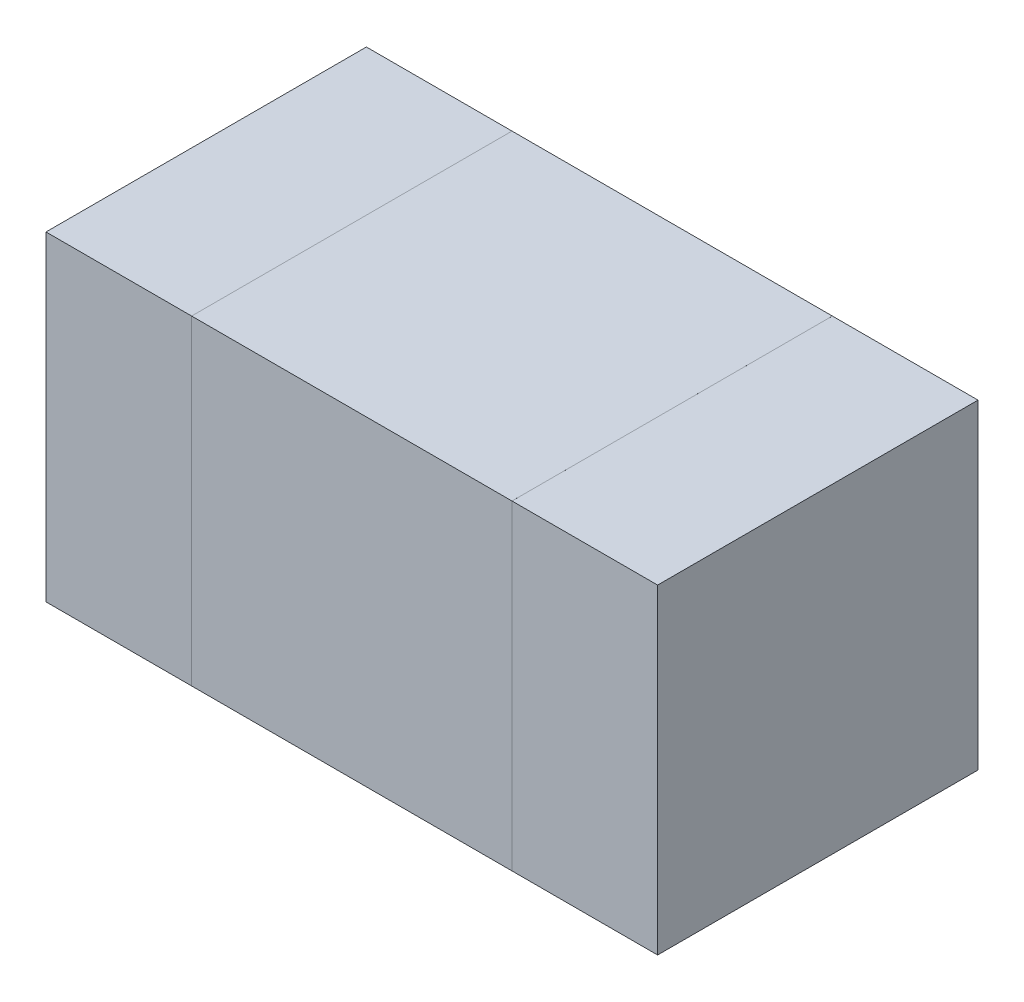
ISO-10303-21;
HEADER;
FILE_DESCRIPTION(('STEP AP214'),'2;1');
FILE_NAME('part.step','',(''),(''),'','','');
FILE_SCHEMA(('AUTOMOTIVE_DESIGN { 1 0 10303 214 1 1 1 1 }'));
ENDSEC;
DATA;
#1=APPLICATION_CONTEXT('core data for automotive mechanical design processes');
#2=APPLICATION_PROTOCOL_DEFINITION('international standard','automotive_design',2000,#1);
#3=PRODUCT_CONTEXT('',#1,'mechanical');
#4=PRODUCT('Part','Part','',(#3));
#5=PRODUCT_RELATED_PRODUCT_CATEGORY('part','',(#4));
#6=PRODUCT_DEFINITION_FORMATION('','',#4);
#7=PRODUCT_DEFINITION_CONTEXT('part definition',#1,'design');
#8=PRODUCT_DEFINITION('design','',#6,#7);
#9=PRODUCT_DEFINITION_SHAPE('','',#8);
#10=(LENGTH_UNIT() NAMED_UNIT(*) SI_UNIT(.MILLI.,.METRE.));
#11=(NAMED_UNIT(*) PLANE_ANGLE_UNIT() SI_UNIT($,.RADIAN.));
#12=(NAMED_UNIT(*) SI_UNIT($,.STERADIAN.) SOLID_ANGLE_UNIT());
#13=UNCERTAINTY_MEASURE_WITH_UNIT(LENGTH_MEASURE(1.E-05),#10,'distance_accuracy_value','');
#14=(GEOMETRIC_REPRESENTATION_CONTEXT(3) GLOBAL_UNCERTAINTY_ASSIGNED_CONTEXT((#13)) GLOBAL_UNIT_ASSIGNED_CONTEXT((#10,
#11,#12)) REPRESENTATION_CONTEXT('',''));
#15=CARTESIAN_POINT('',(0.,0.,0.));
#16=DIRECTION('',(0.,0.,1.));
#17=DIRECTION('',(1.,0.,0.));
#18=AXIS2_PLACEMENT_3D('',#15,#16,#17);
#19=CARTESIAN_POINT('',(2.68499097418,8.760001486074,0.32999934));
#20=DIRECTION('',(0.,0.,-1.));
#21=DIRECTION('',(0.,-1.,0.));
#22=AXIS2_PLACEMENT_3D('',#19,#20,#21);
#23=PLANE('',#22);
#24=DIRECTION('',(1.,0.,0.));
#25=VECTOR('',#24,1.);
#26=CARTESIAN_POINT('',(2.68499097418,8.760001486074,0.32999934));
#27=LINE('',#26,#25);
#28=CARTESIAN_POINT('',(2.68499097418,8.760001486074,0.32999934));
#29=VERTEX_POINT('',#28);
#30=CARTESIAN_POINT('',(3.01499285418,8.760001486074,0.32999934));
#31=VERTEX_POINT('',#30);
#32=EDGE_CURVE('P0_E83',#29,#31,#27,.T.);
#33=ORIENTED_EDGE('',*,*,#32,.T.);
#34=DIRECTION('',(0.,1.,0.));
#35=VECTOR('',#34,1.);
#36=CARTESIAN_POINT('',(3.01499285418,8.760001486074,0.32999934));
#37=LINE('',#36,#35);
#38=CARTESIAN_POINT('',(3.01499285418,9.090000826074,0.32999934));
#39=VERTEX_POINT('',#38);
#40=EDGE_CURVE('P0_E81',#31,#39,#37,.T.);
#41=ORIENTED_EDGE('',*,*,#40,.T.);
#42=DIRECTION('',(-1.,0.,0.));
#43=VECTOR('',#42,1.);
#44=CARTESIAN_POINT('',(3.01499285418,9.090000826074,0.32999934));
#45=LINE('',#44,#43);
#46=CARTESIAN_POINT('',(2.68499097418,9.090000826074,0.32999934));
#47=VERTEX_POINT('',#46);
#48=EDGE_CURVE('P0_E71',#39,#47,#45,.T.);
#49=ORIENTED_EDGE('',*,*,#48,.T.);
#50=DIRECTION('',(0.,-1.,0.));
#51=VECTOR('',#50,1.);
#52=CARTESIAN_POINT('',(2.68499097418,9.090000826074,0.32999934));
#53=LINE('',#52,#51);
#54=EDGE_CURVE('P0_E11',#47,#29,#53,.T.);
#55=ORIENTED_EDGE('',*,*,#54,.T.);
#56=EDGE_LOOP('',(#33,#41,#49,#55));
#57=FACE_BOUND('',#56,.T.);
#58=ADVANCED_FACE('P0_F17',(#57),#23,.F.);
#59=CARTESIAN_POINT('',(2.68499097418,8.760001486074,0.));
#60=DIRECTION('',(0.,0.,-1.));
#61=DIRECTION('',(0.,-1.,0.));
#62=AXIS2_PLACEMENT_3D('',#59,#60,#61);
#63=PLANE('',#62);
#64=DIRECTION('',(0.,-1.,0.));
#65=VECTOR('',#64,1.);
#66=CARTESIAN_POINT('',(2.68499097418,9.090000826074,0.));
#67=LINE('',#66,#65);
#68=CARTESIAN_POINT('',(2.68499097418,9.090000826074,0.));
#69=VERTEX_POINT('',#68);
#70=CARTESIAN_POINT('',(2.68499097418,8.760001486074,0.));
#71=VERTEX_POINT('',#70);
#72=EDGE_CURVE('P0_E20',#69,#71,#67,.T.);
#73=ORIENTED_EDGE('',*,*,#72,.F.);
#74=DIRECTION('',(-1.,0.,0.));
#75=VECTOR('',#74,1.);
#76=CARTESIAN_POINT('',(3.01499285418,9.090000826074,0.));
#77=LINE('',#76,#75);
#78=CARTESIAN_POINT('',(3.01499285418,9.090000826074,0.));
#79=VERTEX_POINT('',#78);
#80=EDGE_CURVE('P0_E64',#79,#69,#77,.T.);
#81=ORIENTED_EDGE('',*,*,#80,.F.);
#82=DIRECTION('',(0.,1.,0.));
#83=VECTOR('',#82,1.);
#84=CARTESIAN_POINT('',(3.01499285418,8.760001486074,0.));
#85=LINE('',#84,#83);
#86=CARTESIAN_POINT('',(3.01499285418,8.760001486074,0.));
#87=VERTEX_POINT('',#86);
#88=EDGE_CURVE('P0_E90',#87,#79,#85,.T.);
#89=ORIENTED_EDGE('',*,*,#88,.F.);
#90=DIRECTION('',(1.,0.,0.));
#91=VECTOR('',#90,1.);
#92=CARTESIAN_POINT('',(2.68499097418,8.760001486074,0.));
#93=LINE('',#92,#91);
#94=EDGE_CURVE('P0_E166',#71,#87,#93,.T.);
#95=ORIENTED_EDGE('',*,*,#94,.F.);
#96=EDGE_LOOP('',(#73,#81,#89,#95));
#97=FACE_BOUND('',#96,.T.);
#98=ADVANCED_FACE('P0_F136',(#97),#63,.T.);
#99=CARTESIAN_POINT('',(2.68499097418,9.090000826074,0.));
#100=DIRECTION('',(1.,0.,0.));
#101=DIRECTION('',(0.,1.,0.));
#102=AXIS2_PLACEMENT_3D('',#99,#100,#101);
#103=PLANE('',#102);
#104=ORIENTED_EDGE('',*,*,#72,.T.);
#105=DIRECTION('',(0.,0.,1.));
#106=VECTOR('',#105,1.);
#107=CARTESIAN_POINT('',(2.68499097418,8.760001486074,0.));
#108=LINE('',#107,#106);
#109=EDGE_CURVE('P0_E95',#71,#29,#108,.T.);
#110=ORIENTED_EDGE('',*,*,#109,.T.);
#111=ORIENTED_EDGE('',*,*,#54,.F.);
#112=DIRECTION('',(0.,0.,1.));
#113=VECTOR('',#112,1.);
#114=CARTESIAN_POINT('',(2.68499097418,9.090000826074,0.));
#115=LINE('',#114,#113);
#116=EDGE_CURVE('P0_E77',#69,#47,#115,.T.);
#117=ORIENTED_EDGE('',*,*,#116,.F.);
#118=EDGE_LOOP('',(#104,#110,#111,#117));
#119=FACE_BOUND('',#118,.T.);
#120=ADVANCED_FACE('P0_F129',(#119),#103,.F.);
#121=CARTESIAN_POINT('',(3.01499285418,9.090000826074,0.));
#122=DIRECTION('',(0.,-1.,0.));
#123=DIRECTION('',(0.,0.,-1.));
#124=AXIS2_PLACEMENT_3D('',#121,#122,#123);
#125=PLANE('',#124);
#126=ORIENTED_EDGE('',*,*,#80,.T.);
#127=ORIENTED_EDGE('',*,*,#116,.T.);
#128=ORIENTED_EDGE('',*,*,#48,.F.);
#129=DIRECTION('',(0.,0.,1.));
#130=VECTOR('',#129,1.);
#131=CARTESIAN_POINT('',(3.01499285418,9.090000826074,0.));
#132=LINE('',#131,#130);
#133=EDGE_CURVE('P0_E75',#79,#39,#132,.T.);
#134=ORIENTED_EDGE('',*,*,#133,.F.);
#135=EDGE_LOOP('',(#126,#127,#128,#134));
#136=FACE_BOUND('',#135,.T.);
#137=ADVANCED_FACE('P0_F73',(#136),#125,.F.);
#138=CARTESIAN_POINT('',(3.01499285418,8.760001486074,0.));
#139=DIRECTION('',(-1.,0.,0.));
#140=DIRECTION('',(0.,0.,1.));
#141=AXIS2_PLACEMENT_3D('',#138,#139,#140);
#142=PLANE('',#141);
#143=ORIENTED_EDGE('',*,*,#88,.T.);
#144=ORIENTED_EDGE('',*,*,#133,.T.);
#145=ORIENTED_EDGE('',*,*,#40,.F.);
#146=DIRECTION('',(0.,0.,1.));
#147=VECTOR('',#146,1.);
#148=CARTESIAN_POINT('',(3.01499285418,8.760001486074,0.));
#149=LINE('',#148,#147);
#150=EDGE_CURVE('P0_E171',#87,#31,#149,.T.);
#151=ORIENTED_EDGE('',*,*,#150,.F.);
#152=EDGE_LOOP('',(#143,#144,#145,#151));
#153=FACE_BOUND('',#152,.T.);
#154=ADVANCED_FACE('P0_F89',(#153),#142,.F.);
#155=CARTESIAN_POINT('',(2.68499097418,8.760001486074,0.));
#156=DIRECTION('',(0.,1.,0.));
#157=DIRECTION('',(1.,0.,0.));
#158=AXIS2_PLACEMENT_3D('',#155,#156,#157);
#159=PLANE('',#158);
#160=ORIENTED_EDGE('',*,*,#94,.T.);
#161=ORIENTED_EDGE('',*,*,#150,.T.);
#162=ORIENTED_EDGE('',*,*,#32,.F.);
#163=ORIENTED_EDGE('',*,*,#109,.F.);
#164=EDGE_LOOP('',(#160,#161,#162,#163));
#165=FACE_BOUND('',#164,.T.);
#166=ADVANCED_FACE('P0_F110',(#165),#159,.F.);
#167=CLOSED_SHELL('',(#58,#98,#120,#137,#154,#166));
#168=MANIFOLD_SOLID_BREP('P0_B1',#167);
#169=CARTESIAN_POINT('',(3.164998527344,8.759998946074,0.32999934));
#170=DIRECTION('',(0.,0.,-1.));
#171=DIRECTION('',(0.,-1.,0.));
#172=AXIS2_PLACEMENT_3D('',#169,#170,#171);
#173=PLANE('',#172);
#174=DIRECTION('',(0.,1.,0.));
#175=VECTOR('',#174,1.);
#176=CARTESIAN_POINT('',(3.164998527344,8.759998946074,0.32999934));
#177=LINE('',#176,#175);
#178=CARTESIAN_POINT('',(3.164998527344,8.759998946074,0.32999934));
#179=VERTEX_POINT('',#178);
#180=CARTESIAN_POINT('',(3.164998527344,9.090000826074,0.32999934));
#181=VERTEX_POINT('',#180);
#182=EDGE_CURVE('P1_E82',#179,#181,#177,.T.);
#183=ORIENTED_EDGE('',*,*,#182,.T.);
#184=DIRECTION('',(-1.,0.,0.));
#185=VECTOR('',#184,1.);
#186=CARTESIAN_POINT('',(3.164998527344,9.090000826074,0.32999934));
#187=LINE('',#186,#185);
#188=CARTESIAN_POINT('',(3.014996287344,9.090000826074,0.32999934));
#189=VERTEX_POINT('',#188);
#190=EDGE_CURVE('P1_E104',#181,#189,#187,.T.);
#191=ORIENTED_EDGE('',*,*,#190,.T.);
#192=DIRECTION('',(0.,-1.,0.));
#193=VECTOR('',#192,1.);
#194=CARTESIAN_POINT('',(3.014996287344,9.090000826074,0.32999934));
#195=LINE('',#194,#193);
#196=CARTESIAN_POINT('',(3.014996287344,8.759998946074,0.32999934));
#197=VERTEX_POINT('',#196);
#198=EDGE_CURVE('P1_E74',#189,#197,#195,.T.);
#199=ORIENTED_EDGE('',*,*,#198,.T.);
#200=DIRECTION('',(1.,0.,0.));
#201=VECTOR('',#200,1.);
#202=CARTESIAN_POINT('',(3.014996287344,8.759998946074,0.32999934));
#203=LINE('',#202,#201);
#204=EDGE_CURVE('P1_E11',#197,#179,#203,.T.);
#205=ORIENTED_EDGE('',*,*,#204,.T.);
#206=EDGE_LOOP('',(#183,#191,#199,#205));
#207=FACE_BOUND('',#206,.T.);
#208=ADVANCED_FACE('P1_F17',(#207),#173,.F.);
#209=CARTESIAN_POINT('',(3.164998527344,8.759998946074,0.));
#210=DIRECTION('',(0.,0.,-1.));
#211=DIRECTION('',(0.,-1.,0.));
#212=AXIS2_PLACEMENT_3D('',#209,#210,#211);
#213=PLANE('',#212);
#214=DIRECTION('',(1.,0.,0.));
#215=VECTOR('',#214,1.);
#216=CARTESIAN_POINT('',(3.014996287344,8.759998946074,0.));
#217=LINE('',#216,#215);
#218=CARTESIAN_POINT('',(3.014996287344,8.759998946074,0.));
#219=VERTEX_POINT('',#218);
#220=CARTESIAN_POINT('',(3.164998527344,8.759998946074,0.));
#221=VERTEX_POINT('',#220);
#222=EDGE_CURVE('P1_E25',#219,#221,#217,.T.);
#223=ORIENTED_EDGE('',*,*,#222,.F.);
#224=DIRECTION('',(0.,-1.,0.));
#225=VECTOR('',#224,1.);
#226=CARTESIAN_POINT('',(3.014996287344,9.090000826074,0.));
#227=LINE('',#226,#225);
#228=CARTESIAN_POINT('',(3.014996287344,9.090000826074,0.));
#229=VERTEX_POINT('',#228);
#230=EDGE_CURVE('P1_E108',#229,#219,#227,.T.);
#231=ORIENTED_EDGE('',*,*,#230,.F.);
#232=DIRECTION('',(-1.,0.,0.));
#233=VECTOR('',#232,1.);
#234=CARTESIAN_POINT('',(3.164998527344,9.090000826074,0.));
#235=LINE('',#234,#233);
#236=CARTESIAN_POINT('',(3.164998527344,9.090000826074,0.));
#237=VERTEX_POINT('',#236);
#238=EDGE_CURVE('P1_E84',#237,#229,#235,.T.);
#239=ORIENTED_EDGE('',*,*,#238,.F.);
#240=DIRECTION('',(0.,1.,0.));
#241=VECTOR('',#240,1.);
#242=CARTESIAN_POINT('',(3.164998527344,8.759998946074,0.));
#243=LINE('',#242,#241);
#244=EDGE_CURVE('P1_E80',#221,#237,#243,.T.);
#245=ORIENTED_EDGE('',*,*,#244,.F.);
#246=EDGE_LOOP('',(#223,#231,#239,#245));
#247=FACE_BOUND('',#246,.T.);
#248=ADVANCED_FACE('P1_F86',(#247),#213,.T.);
#249=CARTESIAN_POINT('',(3.014996287344,8.759998946074,0.));
#250=DIRECTION('',(0.,1.,0.));
#251=DIRECTION('',(1.,0.,0.));
#252=AXIS2_PLACEMENT_3D('',#249,#250,#251);
#253=PLANE('',#252);
#254=ORIENTED_EDGE('',*,*,#222,.T.);
#255=DIRECTION('',(0.,0.,1.));
#256=VECTOR('',#255,1.);
#257=CARTESIAN_POINT('',(3.164998527344,8.759998946074,0.));
#258=LINE('',#257,#256);
#259=EDGE_CURVE('P1_E68',#221,#179,#258,.T.);
#260=ORIENTED_EDGE('',*,*,#259,.T.);
#261=ORIENTED_EDGE('',*,*,#204,.F.);
#262=DIRECTION('',(0.,0.,1.));
#263=VECTOR('',#262,1.);
#264=CARTESIAN_POINT('',(3.014996287344,8.759998946074,0.));
#265=LINE('',#264,#263);
#266=EDGE_CURVE('P1_E71',#219,#197,#265,.T.);
#267=ORIENTED_EDGE('',*,*,#266,.F.);
#268=EDGE_LOOP('',(#254,#260,#261,#267));
#269=FACE_BOUND('',#268,.T.);
#270=ADVANCED_FACE('P1_F67',(#269),#253,.F.);
#271=CARTESIAN_POINT('',(3.014996287344,9.090000826074,0.));
#272=DIRECTION('',(1.,0.,0.));
#273=DIRECTION('',(0.,1.,0.));
#274=AXIS2_PLACEMENT_3D('',#271,#272,#273);
#275=PLANE('',#274);
#276=ORIENTED_EDGE('',*,*,#230,.T.);
#277=ORIENTED_EDGE('',*,*,#266,.T.);
#278=ORIENTED_EDGE('',*,*,#198,.F.);
#279=DIRECTION('',(0.,0.,1.));
#280=VECTOR('',#279,1.);
#281=CARTESIAN_POINT('',(3.014996287344,9.090000826074,0.));
#282=LINE('',#281,#280);
#283=EDGE_CURVE('P1_E97',#229,#189,#282,.T.);
#284=ORIENTED_EDGE('',*,*,#283,.F.);
#285=EDGE_LOOP('',(#276,#277,#278,#284));
#286=FACE_BOUND('',#285,.T.);
#287=ADVANCED_FACE('P1_F117',(#286),#275,.F.);
#288=CARTESIAN_POINT('',(3.164998527344,9.090000826074,0.));
#289=DIRECTION('',(0.,-1.,0.));
#290=DIRECTION('',(0.,0.,-1.));
#291=AXIS2_PLACEMENT_3D('',#288,#289,#290);
#292=PLANE('',#291);
#293=ORIENTED_EDGE('',*,*,#238,.T.);
#294=ORIENTED_EDGE('',*,*,#283,.T.);
#295=ORIENTED_EDGE('',*,*,#190,.F.);
#296=DIRECTION('',(0.,0.,1.));
#297=VECTOR('',#296,1.);
#298=CARTESIAN_POINT('',(3.164998527344,9.090000826074,0.));
#299=LINE('',#298,#297);
#300=EDGE_CURVE('P1_E90',#237,#181,#299,.T.);
#301=ORIENTED_EDGE('',*,*,#300,.F.);
#302=EDGE_LOOP('',(#293,#294,#295,#301));
#303=FACE_BOUND('',#302,.T.);
#304=ADVANCED_FACE('P1_F119',(#303),#292,.F.);
#305=CARTESIAN_POINT('',(3.164998527344,8.759998946074,0.));
#306=DIRECTION('',(-1.,0.,0.));
#307=DIRECTION('',(0.,0.,1.));
#308=AXIS2_PLACEMENT_3D('',#305,#306,#307);
#309=PLANE('',#308);
#310=ORIENTED_EDGE('',*,*,#244,.T.);
#311=ORIENTED_EDGE('',*,*,#300,.T.);
#312=ORIENTED_EDGE('',*,*,#182,.F.);
#313=ORIENTED_EDGE('',*,*,#259,.F.);
#314=EDGE_LOOP('',(#310,#311,#312,#313));
#315=FACE_BOUND('',#314,.T.);
#316=ADVANCED_FACE('P1_F78',(#315),#309,.F.);
#317=CLOSED_SHELL('',(#208,#248,#270,#287,#304,#316));
#318=MANIFOLD_SOLID_BREP('P1_B1',#317);
#319=CARTESIAN_POINT('',(2.685002799805,8.759998946074,0.32999934));
#320=DIRECTION('',(0.,0.,-1.));
#321=DIRECTION('',(0.,-1.,0.));
#322=AXIS2_PLACEMENT_3D('',#319,#320,#321);
#323=PLANE('',#322);
#324=DIRECTION('',(0.,1.,0.));
#325=VECTOR('',#324,1.);
#326=CARTESIAN_POINT('',(2.685002799805,8.759998946074,0.32999934));
#327=LINE('',#326,#325);
#328=CARTESIAN_POINT('',(2.685002799805,8.759998946074,0.32999934));
#329=VERTEX_POINT('',#328);
#330=CARTESIAN_POINT('',(2.685002799805,9.090000826074,0.32999934));
#331=VERTEX_POINT('',#330);
#332=EDGE_CURVE('P2_E95',#329,#331,#327,.T.);
#333=ORIENTED_EDGE('',*,*,#332,.T.);
#334=DIRECTION('',(-1.,0.,0.));
#335=VECTOR('',#334,1.);
#336=CARTESIAN_POINT('',(2.685002799805,9.090000826074,0.32999934));
#337=LINE('',#336,#335);
#338=CARTESIAN_POINT('',(2.535000559805,9.090000826074,0.32999934));
#339=VERTEX_POINT('',#338);
#340=EDGE_CURVE('P2_E76',#331,#339,#337,.T.);
#341=ORIENTED_EDGE('',*,*,#340,.T.);
#342=DIRECTION('',(0.,-1.,0.));
#343=VECTOR('',#342,1.);
#344=CARTESIAN_POINT('',(2.535000559805,9.090000826074,0.32999934));
#345=LINE('',#344,#343);
#346=CARTESIAN_POINT('',(2.535000559805,8.759998946074,0.32999934));
#347=VERTEX_POINT('',#346);
#348=EDGE_CURVE('P2_E81',#339,#347,#345,.T.);
#349=ORIENTED_EDGE('',*,*,#348,.T.);
#350=DIRECTION('',(1.,0.,0.));
#351=VECTOR('',#350,1.);
#352=CARTESIAN_POINT('',(2.535000559805,8.759998946074,0.32999934));
#353=LINE('',#352,#351);
#354=EDGE_CURVE('P2_E11',#347,#329,#353,.T.);
#355=ORIENTED_EDGE('',*,*,#354,.T.);
#356=EDGE_LOOP('',(#333,#341,#349,#355));
#357=FACE_BOUND('',#356,.T.);
#358=ADVANCED_FACE('P2_F17',(#357),#323,.F.);
#359=CARTESIAN_POINT('',(2.685002799805,8.759998946074,0.));
#360=DIRECTION('',(0.,0.,-1.));
#361=DIRECTION('',(0.,-1.,0.));
#362=AXIS2_PLACEMENT_3D('',#359,#360,#361);
#363=PLANE('',#362);
#364=DIRECTION('',(1.,0.,0.));
#365=VECTOR('',#364,1.);
#366=CARTESIAN_POINT('',(2.535000559805,8.759998946074,0.));
#367=LINE('',#366,#365);
#368=CARTESIAN_POINT('',(2.535000559805,8.759998946074,0.));
#369=VERTEX_POINT('',#368);
#370=CARTESIAN_POINT('',(2.685002799805,8.759998946074,0.));
#371=VERTEX_POINT('',#370);
#372=EDGE_CURVE('P2_E20',#369,#371,#367,.T.);
#373=ORIENTED_EDGE('',*,*,#372,.F.);
#374=DIRECTION('',(0.,-1.,0.));
#375=VECTOR('',#374,1.);
#376=CARTESIAN_POINT('',(2.535000559805,9.090000826074,0.));
#377=LINE('',#376,#375);
#378=CARTESIAN_POINT('',(2.535000559805,9.090000826074,0.));
#379=VERTEX_POINT('',#378);
#380=EDGE_CURVE('P2_E64',#379,#369,#377,.T.);
#381=ORIENTED_EDGE('',*,*,#380,.F.);
#382=DIRECTION('',(-1.,0.,0.));
#383=VECTOR('',#382,1.);
#384=CARTESIAN_POINT('',(2.685002799805,9.090000826074,0.));
#385=LINE('',#384,#383);
#386=CARTESIAN_POINT('',(2.685002799805,9.090000826074,0.));
#387=VERTEX_POINT('',#386);
#388=EDGE_CURVE('P2_E69',#387,#379,#385,.T.);
#389=ORIENTED_EDGE('',*,*,#388,.F.);
#390=DIRECTION('',(0.,1.,0.));
#391=VECTOR('',#390,1.);
#392=CARTESIAN_POINT('',(2.685002799805,8.759998946074,0.));
#393=LINE('',#392,#391);
#394=EDGE_CURVE('P2_E112',#371,#387,#393,.T.);
#395=ORIENTED_EDGE('',*,*,#394,.F.);
#396=EDGE_LOOP('',(#373,#381,#389,#395));
#397=FACE_BOUND('',#396,.T.);
#398=ADVANCED_FACE('P2_F66',(#397),#363,.T.);
#399=CARTESIAN_POINT('',(2.535000559805,8.759998946074,0.));
#400=DIRECTION('',(0.,1.,0.));
#401=DIRECTION('',(1.,0.,0.));
#402=AXIS2_PLACEMENT_3D('',#399,#400,#401);
#403=PLANE('',#402);
#404=ORIENTED_EDGE('',*,*,#372,.T.);
#405=DIRECTION('',(0.,0.,1.));
#406=VECTOR('',#405,1.);
#407=CARTESIAN_POINT('',(2.685002799805,8.759998946074,0.));
#408=LINE('',#407,#406);
#409=EDGE_CURVE('P2_E91',#371,#329,#408,.T.);
#410=ORIENTED_EDGE('',*,*,#409,.T.);
#411=ORIENTED_EDGE('',*,*,#354,.F.);
#412=DIRECTION('',(0.,0.,1.));
#413=VECTOR('',#412,1.);
#414=CARTESIAN_POINT('',(2.535000559805,8.759998946074,0.));
#415=LINE('',#414,#413);
#416=EDGE_CURVE('P2_E75',#369,#347,#415,.T.);
#417=ORIENTED_EDGE('',*,*,#416,.F.);
#418=EDGE_LOOP('',(#404,#410,#411,#417));
#419=FACE_BOUND('',#418,.T.);
#420=ADVANCED_FACE('P2_F106',(#419),#403,.F.);
#421=CARTESIAN_POINT('',(2.535000559805,9.090000826074,0.));
#422=DIRECTION('',(1.,0.,0.));
#423=DIRECTION('',(0.,1.,0.));
#424=AXIS2_PLACEMENT_3D('',#421,#422,#423);
#425=PLANE('',#424);
#426=ORIENTED_EDGE('',*,*,#380,.T.);
#427=ORIENTED_EDGE('',*,*,#416,.T.);
#428=ORIENTED_EDGE('',*,*,#348,.F.);
#429=DIRECTION('',(0.,0.,1.));
#430=VECTOR('',#429,1.);
#431=CARTESIAN_POINT('',(2.535000559805,9.090000826074,0.));
#432=LINE('',#431,#430);
#433=EDGE_CURVE('P2_E79',#379,#339,#432,.T.);
#434=ORIENTED_EDGE('',*,*,#433,.F.);
#435=EDGE_LOOP('',(#426,#427,#428,#434));
#436=FACE_BOUND('',#435,.T.);
#437=ADVANCED_FACE('P2_F80',(#436),#425,.F.);
#438=CARTESIAN_POINT('',(2.685002799805,9.090000826074,0.));
#439=DIRECTION('',(0.,-1.,0.));
#440=DIRECTION('',(0.,0.,-1.));
#441=AXIS2_PLACEMENT_3D('',#438,#439,#440);
#442=PLANE('',#441);
#443=ORIENTED_EDGE('',*,*,#388,.T.);
#444=ORIENTED_EDGE('',*,*,#433,.T.);
#445=ORIENTED_EDGE('',*,*,#340,.F.);
#446=DIRECTION('',(0.,0.,1.));
#447=VECTOR('',#446,1.);
#448=CARTESIAN_POINT('',(2.685002799805,9.090000826074,0.));
#449=LINE('',#448,#447);
#450=EDGE_CURVE('P2_E88',#387,#331,#449,.T.);
#451=ORIENTED_EDGE('',*,*,#450,.F.);
#452=EDGE_LOOP('',(#443,#444,#445,#451));
#453=FACE_BOUND('',#452,.T.);
#454=ADVANCED_FACE('P2_F86',(#453),#442,.F.);
#455=CARTESIAN_POINT('',(2.685002799805,8.759998946074,0.));
#456=DIRECTION('',(-1.,0.,0.));
#457=DIRECTION('',(0.,0.,1.));
#458=AXIS2_PLACEMENT_3D('',#455,#456,#457);
#459=PLANE('',#458);
#460=ORIENTED_EDGE('',*,*,#394,.T.);
#461=ORIENTED_EDGE('',*,*,#450,.T.);
#462=ORIENTED_EDGE('',*,*,#332,.F.);
#463=ORIENTED_EDGE('',*,*,#409,.F.);
#464=EDGE_LOOP('',(#460,#461,#462,#463));
#465=FACE_BOUND('',#464,.T.);
#466=ADVANCED_FACE('P2_F111',(#465),#459,.F.);
#467=CLOSED_SHELL('',(#358,#398,#420,#437,#454,#466));
#468=MANIFOLD_SOLID_BREP('P2_B1',#467);
#469=ADVANCED_BREP_SHAPE_REPRESENTATION('',(#18,#168,#318,#468),#14);
#470=SHAPE_DEFINITION_REPRESENTATION(#9,#469);
ENDSEC;
END-ISO-10303-21;
